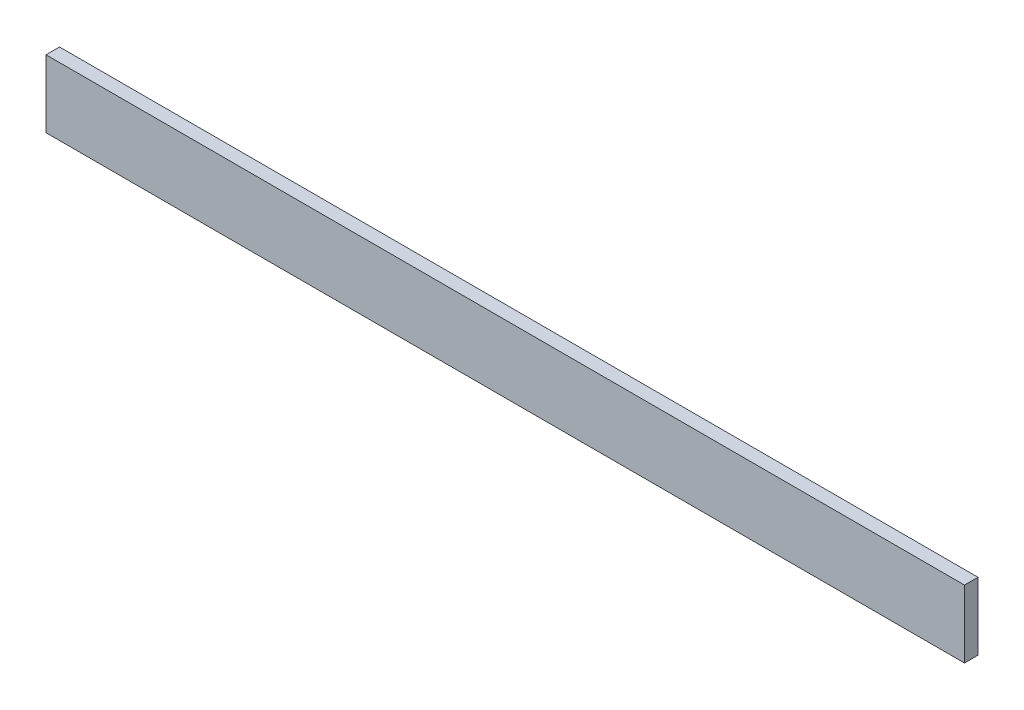
ISO-10303-21;
HEADER;
FILE_DESCRIPTION(('STEP AP214'),'2;1');
FILE_NAME('part.step','',(''),(''),'','','');
FILE_SCHEMA(('AUTOMOTIVE_DESIGN { 1 0 10303 214 1 1 1 1 }'));
ENDSEC;
DATA;
#1=APPLICATION_CONTEXT('core data for automotive mechanical design processes');
#2=APPLICATION_PROTOCOL_DEFINITION('international standard','automotive_design',2000,#1);
#3=PRODUCT_CONTEXT('',#1,'mechanical');
#4=PRODUCT('Part','Part','',(#3));
#5=PRODUCT_RELATED_PRODUCT_CATEGORY('part','',(#4));
#6=PRODUCT_DEFINITION_FORMATION('','',#4);
#7=PRODUCT_DEFINITION_CONTEXT('part definition',#1,'design');
#8=PRODUCT_DEFINITION('design','',#6,#7);
#9=PRODUCT_DEFINITION_SHAPE('','',#8);
#10=(LENGTH_UNIT() NAMED_UNIT(*) SI_UNIT(.MILLI.,.METRE.));
#11=(NAMED_UNIT(*) PLANE_ANGLE_UNIT() SI_UNIT($,.RADIAN.));
#12=(NAMED_UNIT(*) SI_UNIT($,.STERADIAN.) SOLID_ANGLE_UNIT());
#13=UNCERTAINTY_MEASURE_WITH_UNIT(LENGTH_MEASURE(1.E-05),#10,'distance_accuracy_value','');
#14=(GEOMETRIC_REPRESENTATION_CONTEXT(3) GLOBAL_UNCERTAINTY_ASSIGNED_CONTEXT((#13)) GLOBAL_UNIT_ASSIGNED_CONTEXT((#10,
#11,#12)) REPRESENTATION_CONTEXT('',''));
#15=CARTESIAN_POINT('',(0.,0.,0.));
#16=DIRECTION('',(0.,0.,1.));
#17=DIRECTION('',(1.,0.,0.));
#18=AXIS2_PLACEMENT_3D('',#15,#16,#17);
#19=CARTESIAN_POINT('',(680.,0.,0.));
#20=DIRECTION('',(0.,0.,-1.));
#21=DIRECTION('',(-1.,0.,0.));
#22=AXIS2_PLACEMENT_3D('',#19,#20,#21);
#23=PLANE('',#22);
#24=DIRECTION('',(0.,-1.,0.));
#25=VECTOR('',#24,1.);
#26=CARTESIAN_POINT('',(0.,0.,0.));
#27=LINE('',#26,#25);
#28=CARTESIAN_POINT('',(0.,50.,0.));
#29=VERTEX_POINT('',#28);
#30=CARTESIAN_POINT('',(0.,0.,0.));
#31=VERTEX_POINT('',#30);
#32=EDGE_CURVE('E100',#29,#31,#27,.T.);
#33=ORIENTED_EDGE('',*,*,#32,.T.);
#34=DIRECTION('',(-1.,0.,0.));
#35=VECTOR('',#34,1.);
#36=CARTESIAN_POINT('',(680.,0.,0.));
#37=LINE('',#36,#35);
#38=CARTESIAN_POINT('',(680.,0.,0.));
#39=VERTEX_POINT('',#38);
#40=EDGE_CURVE('E11',#39,#31,#37,.T.);
#41=ORIENTED_EDGE('',*,*,#40,.F.);
#42=DIRECTION('',(0.,-1.,0.));
#43=VECTOR('',#42,1.);
#44=CARTESIAN_POINT('',(680.,0.,0.));
#45=LINE('',#44,#43);
#46=CARTESIAN_POINT('',(680.,50.,0.));
#47=VERTEX_POINT('',#46);
#48=EDGE_CURVE('E88',#47,#39,#45,.T.);
#49=ORIENTED_EDGE('',*,*,#48,.F.);
#50=DIRECTION('',(-1.,0.,0.));
#51=VECTOR('',#50,1.);
#52=CARTESIAN_POINT('',(680.,50.,0.));
#53=LINE('',#52,#51);
#54=EDGE_CURVE('E96',#47,#29,#53,.T.);
#55=ORIENTED_EDGE('',*,*,#54,.T.);
#56=EDGE_LOOP('',(#33,#41,#49,#55));
#57=FACE_BOUND('',#56,.T.);
#58=ADVANCED_FACE('F37',(#57),#23,.F.);
#59=CARTESIAN_POINT('',(680.,0.,0.));
#60=DIRECTION('',(0.,1.,0.));
#61=DIRECTION('',(0.,0.,1.));
#62=AXIS2_PLACEMENT_3D('',#59,#60,#61);
#63=PLANE('',#62);
#64=DIRECTION('',(0.,0.,-1.));
#65=VECTOR('',#64,1.);
#66=CARTESIAN_POINT('',(0.,0.,0.));
#67=LINE('',#66,#65);
#68=CARTESIAN_POINT('',(0.,0.,-10.));
#69=VERTEX_POINT('',#68);
#70=EDGE_CURVE('E92',#31,#69,#67,.T.);
#71=ORIENTED_EDGE('',*,*,#70,.T.);
#72=DIRECTION('',(-1.,0.,0.));
#73=VECTOR('',#72,1.);
#74=CARTESIAN_POINT('',(680.,0.,-10.));
#75=LINE('',#74,#73);
#76=CARTESIAN_POINT('',(680.,0.,-10.));
#77=VERTEX_POINT('',#76);
#78=EDGE_CURVE('E45',#77,#69,#75,.T.);
#79=ORIENTED_EDGE('',*,*,#78,.F.);
#80=DIRECTION('',(0.,0.,-1.));
#81=VECTOR('',#80,1.);
#82=CARTESIAN_POINT('',(680.,0.,0.));
#83=LINE('',#82,#81);
#84=EDGE_CURVE('E83',#39,#77,#83,.T.);
#85=ORIENTED_EDGE('',*,*,#84,.F.);
#86=ORIENTED_EDGE('',*,*,#40,.T.);
#87=EDGE_LOOP('',(#71,#79,#85,#86));
#88=FACE_BOUND('',#87,.T.);
#89=ADVANCED_FACE('F91',(#88),#63,.F.);
#90=CARTESIAN_POINT('',(680.,0.,-10.));
#91=DIRECTION('',(0.,0.,1.));
#92=DIRECTION('',(1.,0.,0.));
#93=AXIS2_PLACEMENT_3D('',#90,#91,#92);
#94=PLANE('',#93);
#95=DIRECTION('',(0.,1.,0.));
#96=VECTOR('',#95,1.);
#97=CARTESIAN_POINT('',(0.,0.,-10.));
#98=LINE('',#97,#96);
#99=CARTESIAN_POINT('',(0.,50.,-10.));
#100=VERTEX_POINT('',#99);
#101=EDGE_CURVE('E70',#69,#100,#98,.T.);
#102=ORIENTED_EDGE('',*,*,#101,.T.);
#103=DIRECTION('',(-1.,0.,0.));
#104=VECTOR('',#103,1.);
#105=CARTESIAN_POINT('',(680.,50.,-10.));
#106=LINE('',#105,#104);
#107=CARTESIAN_POINT('',(680.,50.,-10.));
#108=VERTEX_POINT('',#107);
#109=EDGE_CURVE('E93',#108,#100,#106,.T.);
#110=ORIENTED_EDGE('',*,*,#109,.F.);
#111=DIRECTION('',(0.,1.,0.));
#112=VECTOR('',#111,1.);
#113=CARTESIAN_POINT('',(680.,0.,-10.));
#114=LINE('',#113,#112);
#115=EDGE_CURVE('E86',#77,#108,#114,.T.);
#116=ORIENTED_EDGE('',*,*,#115,.F.);
#117=ORIENTED_EDGE('',*,*,#78,.T.);
#118=EDGE_LOOP('',(#102,#110,#116,#117));
#119=FACE_BOUND('',#118,.T.);
#120=ADVANCED_FACE('F94',(#119),#94,.F.);
#121=CARTESIAN_POINT('',(680.,50.,0.));
#122=DIRECTION('',(0.,-1.,0.));
#123=DIRECTION('',(0.,0.,-1.));
#124=AXIS2_PLACEMENT_3D('',#121,#122,#123);
#125=PLANE('',#124);
#126=DIRECTION('',(0.,0.,1.));
#127=VECTOR('',#126,1.);
#128=CARTESIAN_POINT('',(0.,50.,0.));
#129=LINE('',#128,#127);
#130=EDGE_CURVE('E76',#100,#29,#129,.T.);
#131=ORIENTED_EDGE('',*,*,#130,.T.);
#132=ORIENTED_EDGE('',*,*,#54,.F.);
#133=DIRECTION('',(0.,0.,1.));
#134=VECTOR('',#133,1.);
#135=CARTESIAN_POINT('',(680.,50.,0.));
#136=LINE('',#135,#134);
#137=EDGE_CURVE('E53',#108,#47,#136,.T.);
#138=ORIENTED_EDGE('',*,*,#137,.F.);
#139=ORIENTED_EDGE('',*,*,#109,.T.);
#140=EDGE_LOOP('',(#131,#132,#138,#139));
#141=FACE_BOUND('',#140,.T.);
#142=ADVANCED_FACE('F107',(#141),#125,.F.);
#143=CARTESIAN_POINT('',(680.,0.,0.));
#144=DIRECTION('',(-1.,0.,0.));
#145=DIRECTION('',(0.,0.,1.));
#146=AXIS2_PLACEMENT_3D('',#143,#144,#145);
#147=PLANE('',#146);
#148=ORIENTED_EDGE('',*,*,#48,.T.);
#149=ORIENTED_EDGE('',*,*,#84,.T.);
#150=ORIENTED_EDGE('',*,*,#115,.T.);
#151=ORIENTED_EDGE('',*,*,#137,.T.);
#152=EDGE_LOOP('',(#148,#149,#150,#151));
#153=FACE_BOUND('',#152,.T.);
#154=ADVANCED_FACE('F84',(#153),#147,.F.);
#155=CARTESIAN_POINT('',(0.,0.,0.));
#156=DIRECTION('',(-1.,0.,0.));
#157=DIRECTION('',(0.,0.,1.));
#158=AXIS2_PLACEMENT_3D('',#155,#156,#157);
#159=PLANE('',#158);
#160=ORIENTED_EDGE('',*,*,#32,.F.);
#161=ORIENTED_EDGE('',*,*,#130,.F.);
#162=ORIENTED_EDGE('',*,*,#101,.F.);
#163=ORIENTED_EDGE('',*,*,#70,.F.);
#164=EDGE_LOOP('',(#160,#161,#162,#163));
#165=FACE_BOUND('',#164,.T.);
#166=ADVANCED_FACE('F110',(#165),#159,.T.);
#167=CLOSED_SHELL('',(#58,#89,#120,#142,#154,#166));
#168=MANIFOLD_SOLID_BREP('B2',#167);
#169=ADVANCED_BREP_SHAPE_REPRESENTATION('',(#18,#168),#14);
#170=SHAPE_DEFINITION_REPRESENTATION(#9,#169);
ENDSEC;
END-ISO-10303-21;
